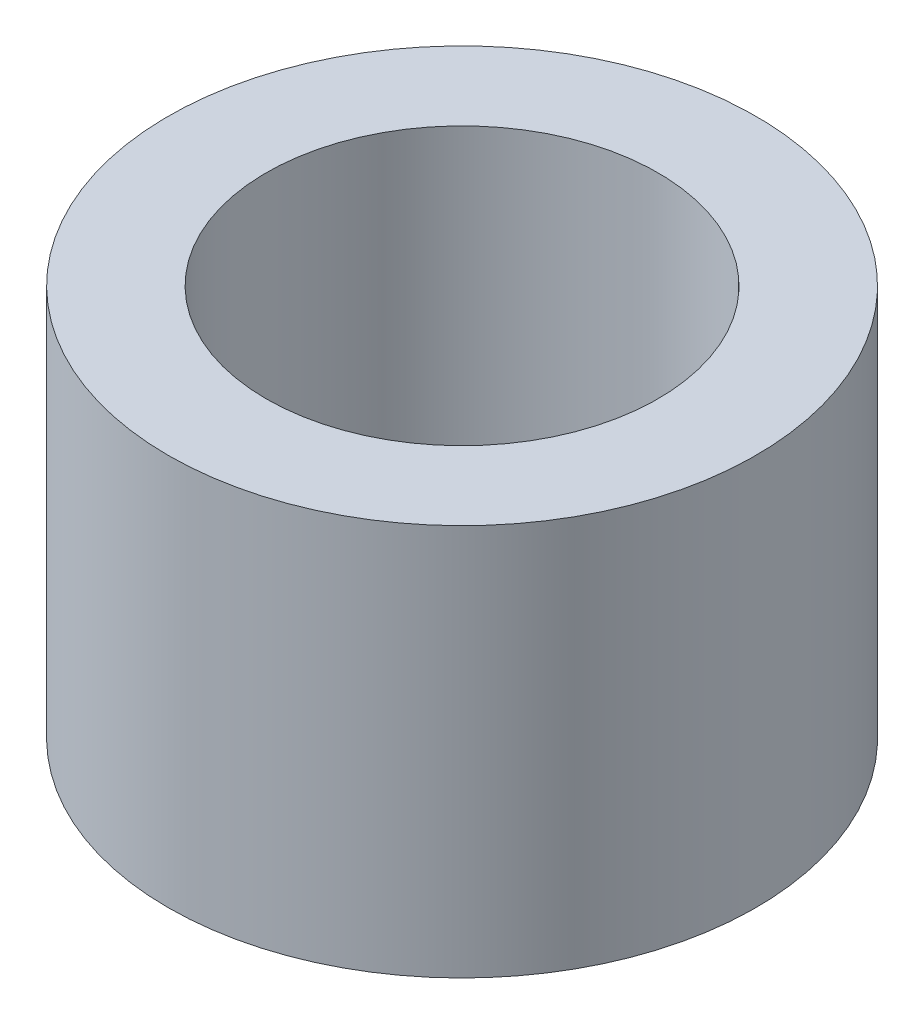
ISO-10303-21;
HEADER;
FILE_DESCRIPTION(('STEP AP214'),'2;1');
FILE_NAME('part.step','',(''),(''),'','','');
FILE_SCHEMA(('AUTOMOTIVE_DESIGN { 1 0 10303 214 1 1 1 1 }'));
ENDSEC;
DATA;
#1=APPLICATION_CONTEXT('core data for automotive mechanical design processes');
#2=APPLICATION_PROTOCOL_DEFINITION('international standard','automotive_design',2000,#1);
#3=PRODUCT_CONTEXT('',#1,'mechanical');
#4=PRODUCT('Part','Part','',(#3));
#5=PRODUCT_RELATED_PRODUCT_CATEGORY('part','',(#4));
#6=PRODUCT_DEFINITION_FORMATION('','',#4);
#7=PRODUCT_DEFINITION_CONTEXT('part definition',#1,'design');
#8=PRODUCT_DEFINITION('design','',#6,#7);
#9=PRODUCT_DEFINITION_SHAPE('','',#8);
#10=(LENGTH_UNIT() NAMED_UNIT(*) SI_UNIT(.MILLI.,.METRE.));
#11=(NAMED_UNIT(*) PLANE_ANGLE_UNIT() SI_UNIT($,.RADIAN.));
#12=(NAMED_UNIT(*) SI_UNIT($,.STERADIAN.) SOLID_ANGLE_UNIT());
#13=UNCERTAINTY_MEASURE_WITH_UNIT(LENGTH_MEASURE(1.E-05),#10,'distance_accuracy_value','');
#14=(GEOMETRIC_REPRESENTATION_CONTEXT(3) GLOBAL_UNCERTAINTY_ASSIGNED_CONTEXT((#13)) GLOBAL_UNIT_ASSIGNED_CONTEXT((#10,
#11,#12)) REPRESENTATION_CONTEXT('',''));
#15=CARTESIAN_POINT('',(0.,0.,0.));
#16=DIRECTION('',(0.,0.,1.));
#17=DIRECTION('',(1.,0.,0.));
#18=AXIS2_PLACEMENT_3D('',#15,#16,#17);
#19=CARTESIAN_POINT('',(0.,6.35,0.));
#20=DIRECTION('',(0.,1.,0.));
#21=DIRECTION('',(0.,0.,1.));
#22=AXIS2_PLACEMENT_3D('',#19,#20,#21);
#23=PLANE('',#22);
#24=CARTESIAN_POINT('',(0.,6.35,0.));
#25=DIRECTION('',(0.,1.,0.));
#26=DIRECTION('',(0.,0.,1.));
#27=AXIS2_PLACEMENT_3D('',#24,#25,#26);
#28=CIRCLE('',#27,4.7625);
#29=CARTESIAN_POINT('',(0.,6.35,4.7625));
#30=VERTEX_POINT('',#29);
#31=EDGE_CURVE('E10',#30,#30,#28,.T.);
#32=ORIENTED_EDGE('',*,*,#31,.T.);
#33=EDGE_LOOP('',(#32));
#34=FACE_BOUND('',#33,.T.);
#35=CARTESIAN_POINT('',(0.,6.35,0.));
#36=DIRECTION('',(0.,1.,0.));
#37=DIRECTION('',(0.,0.,1.));
#38=AXIS2_PLACEMENT_3D('',#35,#36,#37);
#39=CIRCLE('',#38,3.175);
#40=CARTESIAN_POINT('',(0.,6.35,3.175));
#41=VERTEX_POINT('',#40);
#42=EDGE_CURVE('E41',#41,#41,#39,.T.);
#43=ORIENTED_EDGE('',*,*,#42,.F.);
#44=EDGE_LOOP('',(#43));
#45=FACE_BOUND('',#44,.T.);
#46=ADVANCED_FACE('F30',(#34,#45),#23,.T.);
#47=CARTESIAN_POINT('',(0.,0.,0.));
#48=DIRECTION('',(0.,1.,0.));
#49=DIRECTION('',(0.,0.,1.));
#50=AXIS2_PLACEMENT_3D('',#47,#48,#49);
#51=PLANE('',#50);
#52=CARTESIAN_POINT('',(0.,0.,0.));
#53=DIRECTION('',(0.,1.,0.));
#54=DIRECTION('',(0.,0.,1.));
#55=AXIS2_PLACEMENT_3D('',#52,#53,#54);
#56=CIRCLE('',#55,4.7625);
#57=CARTESIAN_POINT('',(0.,0.,4.7625));
#58=VERTEX_POINT('',#57);
#59=EDGE_CURVE('E34',#58,#58,#56,.T.);
#60=ORIENTED_EDGE('',*,*,#59,.F.);
#61=EDGE_LOOP('',(#60));
#62=FACE_BOUND('',#61,.T.);
#63=CARTESIAN_POINT('',(0.,0.,0.));
#64=DIRECTION('',(0.,1.,0.));
#65=DIRECTION('',(0.,0.,1.));
#66=AXIS2_PLACEMENT_3D('',#63,#64,#65);
#67=CIRCLE('',#66,3.175);
#68=CARTESIAN_POINT('',(0.,0.,3.175));
#69=VERTEX_POINT('',#68);
#70=EDGE_CURVE('E43',#69,#69,#67,.T.);
#71=ORIENTED_EDGE('',*,*,#70,.T.);
#72=EDGE_LOOP('',(#71));
#73=FACE_BOUND('',#72,.T.);
#74=ADVANCED_FACE('F53',(#62,#73),#51,.F.);
#75=CARTESIAN_POINT('',(0.,6.35,0.));
#76=DIRECTION('',(0.,-1.,0.));
#77=DIRECTION('',(0.,0.,-1.));
#78=AXIS2_PLACEMENT_3D('',#75,#76,#77);
#79=CYLINDRICAL_SURFACE('',#78,4.7625);
#80=ORIENTED_EDGE('',*,*,#31,.F.);
#81=EDGE_LOOP('',(#80));
#82=FACE_BOUND('',#81,.T.);
#83=ORIENTED_EDGE('',*,*,#59,.T.);
#84=EDGE_LOOP('',(#83));
#85=FACE_BOUND('',#84,.T.);
#86=ADVANCED_FACE('F32',(#82,#85),#79,.T.);
#87=CARTESIAN_POINT('',(0.,6.35,0.));
#88=DIRECTION('',(0.,-1.,0.));
#89=DIRECTION('',(0.,0.,-1.));
#90=AXIS2_PLACEMENT_3D('',#87,#88,#89);
#91=CYLINDRICAL_SURFACE('',#90,3.175);
#92=ORIENTED_EDGE('',*,*,#42,.T.);
#93=EDGE_LOOP('',(#92));
#94=FACE_BOUND('',#93,.T.);
#95=ORIENTED_EDGE('',*,*,#70,.F.);
#96=EDGE_LOOP('',(#95));
#97=FACE_BOUND('',#96,.T.);
#98=ADVANCED_FACE('F49',(#94,#97),#91,.F.);
#99=CLOSED_SHELL('',(#46,#74,#86,#98));
#100=MANIFOLD_SOLID_BREP('B2',#99);
#101=ADVANCED_BREP_SHAPE_REPRESENTATION('',(#18,#100),#14);
#102=SHAPE_DEFINITION_REPRESENTATION(#9,#101);
ENDSEC;
END-ISO-10303-21;
